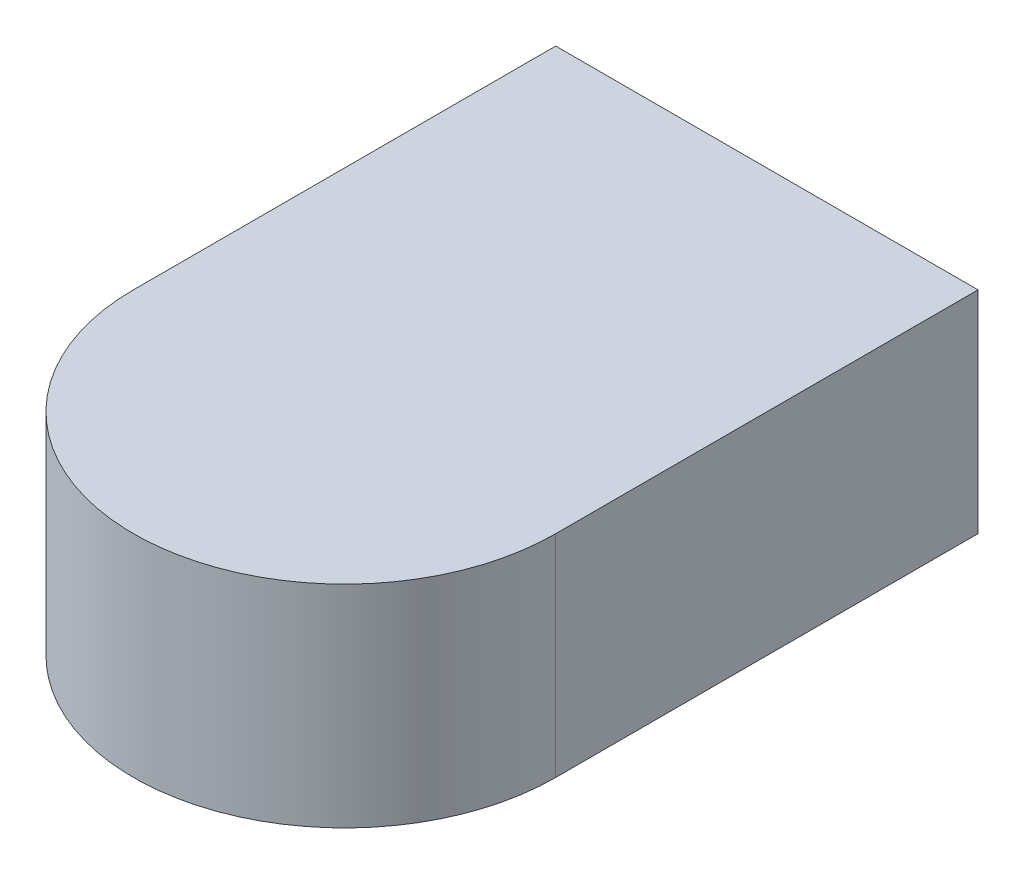
ISO-10303-21;
HEADER;
FILE_DESCRIPTION(('STEP AP214'),'2;1');
FILE_NAME('part.step','',(''),(''),'','','');
FILE_SCHEMA(('AUTOMOTIVE_DESIGN { 1 0 10303 214 1 1 1 1 }'));
ENDSEC;
DATA;
#1=APPLICATION_CONTEXT('core data for automotive mechanical design processes');
#2=APPLICATION_PROTOCOL_DEFINITION('international standard','automotive_design',2000,#1);
#3=PRODUCT_CONTEXT('',#1,'mechanical');
#4=PRODUCT('Part','Part','',(#3));
#5=PRODUCT_RELATED_PRODUCT_CATEGORY('part','',(#4));
#6=PRODUCT_DEFINITION_FORMATION('','',#4);
#7=PRODUCT_DEFINITION_CONTEXT('part definition',#1,'design');
#8=PRODUCT_DEFINITION('design','',#6,#7);
#9=PRODUCT_DEFINITION_SHAPE('','',#8);
#10=(LENGTH_UNIT() NAMED_UNIT(*) SI_UNIT(.MILLI.,.METRE.));
#11=(NAMED_UNIT(*) PLANE_ANGLE_UNIT() SI_UNIT($,.RADIAN.));
#12=(NAMED_UNIT(*) SI_UNIT($,.STERADIAN.) SOLID_ANGLE_UNIT());
#13=UNCERTAINTY_MEASURE_WITH_UNIT(LENGTH_MEASURE(1.E-05),#10,'distance_accuracy_value','');
#14=(GEOMETRIC_REPRESENTATION_CONTEXT(3) GLOBAL_UNCERTAINTY_ASSIGNED_CONTEXT((#13)) GLOBAL_UNIT_ASSIGNED_CONTEXT((#10,
#11,#12)) REPRESENTATION_CONTEXT('',''));
#15=CARTESIAN_POINT('',(0.,0.,0.));
#16=DIRECTION('',(0.,0.,1.));
#17=DIRECTION('',(1.,0.,0.));
#18=AXIS2_PLACEMENT_3D('',#15,#16,#17);
#19=CARTESIAN_POINT('',(0.,0.,0.));
#20=DIRECTION('',(0.,1.,0.));
#21=DIRECTION('',(1.,0.,0.));
#22=AXIS2_PLACEMENT_3D('',#19,#20,#21);
#23=PLANE('',#22);
#24=DIRECTION('',(-1.,0.,0.));
#25=VECTOR('',#24,1.);
#26=CARTESIAN_POINT('',(-0.3,0.,-2.25));
#27=LINE('',#26,#25);
#28=CARTESIAN_POINT('',(-0.3,0.,-2.25));
#29=VERTEX_POINT('',#28);
#30=CARTESIAN_POINT('',(-0.5,0.,-2.25));
#31=VERTEX_POINT('',#30);
#32=EDGE_CURVE('E11',#29,#31,#27,.T.);
#33=ORIENTED_EDGE('',*,*,#32,.F.);
#34=DIRECTION('',(0.,0.,-1.));
#35=VECTOR('',#34,1.);
#36=CARTESIAN_POINT('',(-0.3,0.,-2.05));
#37=LINE('',#36,#35);
#38=CARTESIAN_POINT('',(-0.3,0.,-2.05));
#39=VERTEX_POINT('',#38);
#40=EDGE_CURVE('E25',#39,#29,#37,.T.);
#41=ORIENTED_EDGE('',*,*,#40,.F.);
#42=CARTESIAN_POINT('',(-0.4,0.,-2.05));
#43=DIRECTION('',(0.,1.,0.));
#44=DIRECTION('',(-1.,0.,0.));
#45=AXIS2_PLACEMENT_3D('',#42,#43,#44);
#46=CIRCLE('',#45,0.1);
#47=CARTESIAN_POINT('',(-0.5,0.,-2.05));
#48=VERTEX_POINT('',#47);
#49=EDGE_CURVE('E73',#48,#39,#46,.T.);
#50=ORIENTED_EDGE('',*,*,#49,.F.);
#51=DIRECTION('',(0.,0.,1.));
#52=VECTOR('',#51,1.);
#53=CARTESIAN_POINT('',(-0.5,0.,-2.25));
#54=LINE('',#53,#52);
#55=EDGE_CURVE('E99',#31,#48,#54,.T.);
#56=ORIENTED_EDGE('',*,*,#55,.F.);
#57=EDGE_LOOP('',(#33,#41,#50,#56));
#58=FACE_BOUND('',#57,.T.);
#59=ADVANCED_FACE('F17',(#58),#23,.F.);
#60=CARTESIAN_POINT('',(-0.5,0.,-2.25));
#61=DIRECTION('',(-1.,0.,0.));
#62=DIRECTION('',(0.,0.,1.));
#63=AXIS2_PLACEMENT_3D('',#60,#61,#62);
#64=PLANE('',#63);
#65=DIRECTION('',(0.,1.,0.));
#66=VECTOR('',#65,1.);
#67=CARTESIAN_POINT('',(-0.5,0.,-2.05));
#68=LINE('',#67,#66);
#69=CARTESIAN_POINT('',(-0.5,0.1,-2.05));
#70=VERTEX_POINT('',#69);
#71=EDGE_CURVE('E95',#48,#70,#68,.T.);
#72=ORIENTED_EDGE('',*,*,#71,.T.);
#73=DIRECTION('',(0.,0.,1.));
#74=VECTOR('',#73,1.);
#75=CARTESIAN_POINT('',(-0.5,0.1,-2.25));
#76=LINE('',#75,#74);
#77=CARTESIAN_POINT('',(-0.5,0.1,-2.25));
#78=VERTEX_POINT('',#77);
#79=EDGE_CURVE('E68',#78,#70,#76,.T.);
#80=ORIENTED_EDGE('',*,*,#79,.F.);
#81=DIRECTION('',(0.,1.,0.));
#82=VECTOR('',#81,1.);
#83=CARTESIAN_POINT('',(-0.5,0.,-2.25));
#84=LINE('',#83,#82);
#85=EDGE_CURVE('E87',#31,#78,#84,.T.);
#86=ORIENTED_EDGE('',*,*,#85,.F.);
#87=ORIENTED_EDGE('',*,*,#55,.T.);
#88=EDGE_LOOP('',(#72,#80,#86,#87));
#89=FACE_BOUND('',#88,.T.);
#90=ADVANCED_FACE('F113',(#89),#64,.T.);
#91=CARTESIAN_POINT('',(-0.3,0.,-2.25));
#92=DIRECTION('',(0.,0.,-1.));
#93=DIRECTION('',(-1.,0.,0.));
#94=AXIS2_PLACEMENT_3D('',#91,#92,#93);
#95=PLANE('',#94);
#96=ORIENTED_EDGE('',*,*,#85,.T.);
#97=DIRECTION('',(-1.,0.,0.));
#98=VECTOR('',#97,1.);
#99=CARTESIAN_POINT('',(-0.3,0.1,-2.25));
#100=LINE('',#99,#98);
#101=CARTESIAN_POINT('',(-0.3,0.1,-2.25));
#102=VERTEX_POINT('',#101);
#103=EDGE_CURVE('E83',#102,#78,#100,.T.);
#104=ORIENTED_EDGE('',*,*,#103,.F.);
#105=DIRECTION('',(0.,1.,0.));
#106=VECTOR('',#105,1.);
#107=CARTESIAN_POINT('',(-0.3,0.,-2.25));
#108=LINE('',#107,#106);
#109=EDGE_CURVE('E60',#29,#102,#108,.T.);
#110=ORIENTED_EDGE('',*,*,#109,.F.);
#111=ORIENTED_EDGE('',*,*,#32,.T.);
#112=EDGE_LOOP('',(#96,#104,#110,#111));
#113=FACE_BOUND('',#112,.T.);
#114=ADVANCED_FACE('F119',(#113),#95,.T.);
#115=CARTESIAN_POINT('',(-0.3,0.,-2.05));
#116=DIRECTION('',(1.,0.,0.));
#117=DIRECTION('',(0.,0.,-1.));
#118=AXIS2_PLACEMENT_3D('',#115,#116,#117);
#119=PLANE('',#118);
#120=ORIENTED_EDGE('',*,*,#109,.T.);
#121=DIRECTION('',(0.,0.,-1.));
#122=VECTOR('',#121,1.);
#123=CARTESIAN_POINT('',(-0.3,0.1,-2.05));
#124=LINE('',#123,#122);
#125=CARTESIAN_POINT('',(-0.3,0.1,-2.05));
#126=VERTEX_POINT('',#125);
#127=EDGE_CURVE('E54',#126,#102,#124,.T.);
#128=ORIENTED_EDGE('',*,*,#127,.F.);
#129=DIRECTION('',(0.,1.,0.));
#130=VECTOR('',#129,1.);
#131=CARTESIAN_POINT('',(-0.3,0.,-2.05));
#132=LINE('',#131,#130);
#133=EDGE_CURVE('E58',#39,#126,#132,.T.);
#134=ORIENTED_EDGE('',*,*,#133,.F.);
#135=ORIENTED_EDGE('',*,*,#40,.T.);
#136=EDGE_LOOP('',(#120,#128,#134,#135));
#137=FACE_BOUND('',#136,.T.);
#138=ADVANCED_FACE('F56',(#137),#119,.T.);
#139=CARTESIAN_POINT('',(-0.4,0.,-2.05));
#140=DIRECTION('',(0.,1.,0.));
#141=DIRECTION('',(0.,0.,-1.));
#142=AXIS2_PLACEMENT_3D('',#139,#140,#141);
#143=CYLINDRICAL_SURFACE('',#142,0.1);
#144=ORIENTED_EDGE('',*,*,#133,.T.);
#145=CARTESIAN_POINT('',(-0.4,0.1,-2.05));
#146=DIRECTION('',(0.,1.,0.));
#147=DIRECTION('',(-1.,0.,0.));
#148=AXIS2_PLACEMENT_3D('',#145,#146,#147);
#149=CIRCLE('',#148,0.1);
#150=EDGE_CURVE('E66',#70,#126,#149,.T.);
#151=ORIENTED_EDGE('',*,*,#150,.F.);
#152=ORIENTED_EDGE('',*,*,#71,.F.);
#153=ORIENTED_EDGE('',*,*,#49,.T.);
#154=EDGE_LOOP('',(#144,#151,#152,#153));
#155=FACE_BOUND('',#154,.T.);
#156=ADVANCED_FACE('F72',(#155),#143,.T.);
#157=CARTESIAN_POINT('',(0.,0.1,0.));
#158=DIRECTION('',(0.,1.,0.));
#159=DIRECTION('',(1.,0.,0.));
#160=AXIS2_PLACEMENT_3D('',#157,#158,#159);
#161=PLANE('',#160);
#162=ORIENTED_EDGE('',*,*,#150,.T.);
#163=ORIENTED_EDGE('',*,*,#127,.T.);
#164=ORIENTED_EDGE('',*,*,#103,.T.);
#165=ORIENTED_EDGE('',*,*,#79,.T.);
#166=EDGE_LOOP('',(#162,#163,#164,#165));
#167=FACE_BOUND('',#166,.T.);
#168=ADVANCED_FACE('F67',(#167),#161,.T.);
#169=CLOSED_SHELL('',(#59,#90,#114,#138,#156,#168));
#170=MANIFOLD_SOLID_BREP('B1',#169);
#171=ADVANCED_BREP_SHAPE_REPRESENTATION('',(#18,#170),#14);
#172=SHAPE_DEFINITION_REPRESENTATION(#9,#171);
ENDSEC;
END-ISO-10303-21;
